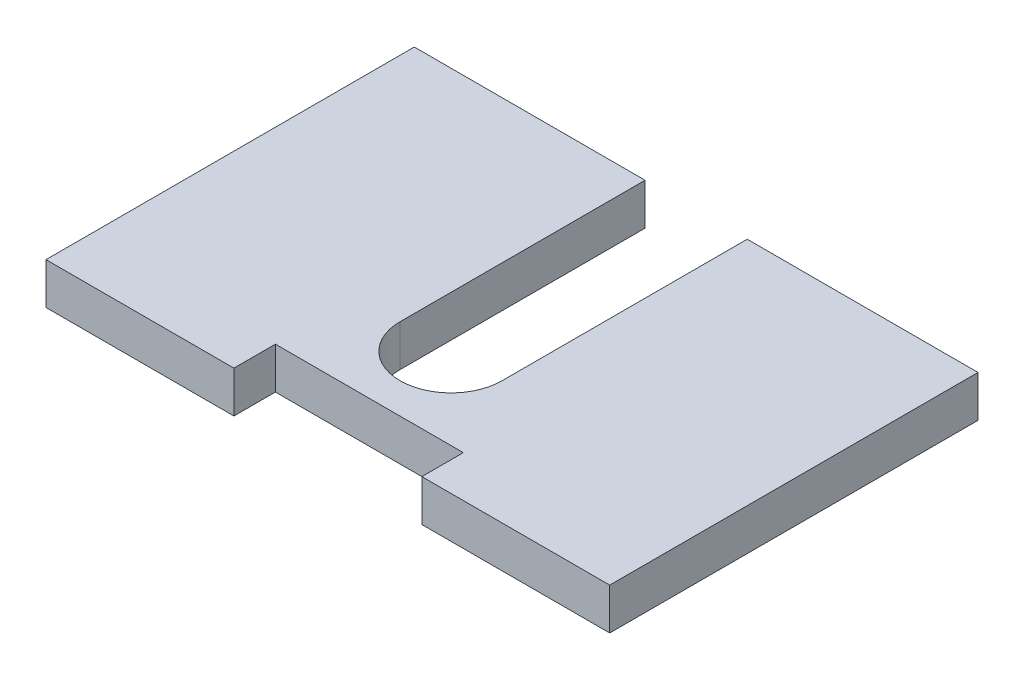
ISO-10303-21;
HEADER;
FILE_DESCRIPTION(('STEP AP214'),'2;1');
FILE_NAME('part.step','',(''),(''),'','','');
FILE_SCHEMA(('AUTOMOTIVE_DESIGN { 1 0 10303 214 1 1 1 1 }'));
ENDSEC;
DATA;
#1=APPLICATION_CONTEXT('core data for automotive mechanical design processes');
#2=APPLICATION_PROTOCOL_DEFINITION('international standard','automotive_design',2000,#1);
#3=PRODUCT_CONTEXT('',#1,'mechanical');
#4=PRODUCT('Part','Part','',(#3));
#5=PRODUCT_RELATED_PRODUCT_CATEGORY('part','',(#4));
#6=PRODUCT_DEFINITION_FORMATION('','',#4);
#7=PRODUCT_DEFINITION_CONTEXT('part definition',#1,'design');
#8=PRODUCT_DEFINITION('design','',#6,#7);
#9=PRODUCT_DEFINITION_SHAPE('','',#8);
#10=(LENGTH_UNIT() NAMED_UNIT(*) SI_UNIT(.MILLI.,.METRE.));
#11=(NAMED_UNIT(*) PLANE_ANGLE_UNIT() SI_UNIT($,.RADIAN.));
#12=(NAMED_UNIT(*) SI_UNIT($,.STERADIAN.) SOLID_ANGLE_UNIT());
#13=UNCERTAINTY_MEASURE_WITH_UNIT(LENGTH_MEASURE(1.E-05),#10,'distance_accuracy_value','');
#14=(GEOMETRIC_REPRESENTATION_CONTEXT(3) GLOBAL_UNCERTAINTY_ASSIGNED_CONTEXT((#13)) GLOBAL_UNIT_ASSIGNED_CONTEXT((#10,
#11,#12)) REPRESENTATION_CONTEXT('',''));
#15=CARTESIAN_POINT('',(0.,0.,0.));
#16=DIRECTION('',(0.,0.,1.));
#17=DIRECTION('',(1.,0.,0.));
#18=AXIS2_PLACEMENT_3D('',#15,#16,#17);
#19=CARTESIAN_POINT('',(0.,5.08,-40.));
#20=DIRECTION('',(0.,0.,1.));
#21=DIRECTION('',(1.,0.,0.));
#22=AXIS2_PLACEMENT_3D('',#19,#20,#21);
#23=PLANE('',#22);
#24=DIRECTION('',(0.,1.,0.));
#25=VECTOR('',#24,1.);
#26=CARTESIAN_POINT('',(-40.75,0.,-40.));
#27=LINE('',#26,#25);
#28=CARTESIAN_POINT('',(-40.75,0.,-40.));
#29=VERTEX_POINT('',#28);
#30=CARTESIAN_POINT('',(-40.75,5.08,-40.));
#31=VERTEX_POINT('',#30);
#32=EDGE_CURVE('E153',#29,#31,#27,.T.);
#33=ORIENTED_EDGE('',*,*,#32,.F.);
#34=DIRECTION('',(-1.,0.,0.));
#35=VECTOR('',#34,1.);
#36=CARTESIAN_POINT('',(0.,0.,-40.));
#37=LINE('',#36,#35);
#38=CARTESIAN_POINT('',(-69.,0.,-40.));
#39=VERTEX_POINT('',#38);
#40=EDGE_CURVE('E208',#29,#39,#37,.T.);
#41=ORIENTED_EDGE('',*,*,#40,.T.);
#42=DIRECTION('',(0.,-1.,0.));
#43=VECTOR('',#42,1.);
#44=CARTESIAN_POINT('',(-69.,5.08,-40.));
#45=LINE('',#44,#43);
#46=CARTESIAN_POINT('',(-69.,5.08,-40.));
#47=VERTEX_POINT('',#46);
#48=EDGE_CURVE('E43',#47,#39,#45,.T.);
#49=ORIENTED_EDGE('',*,*,#48,.F.);
#50=DIRECTION('',(-1.,0.,0.));
#51=VECTOR('',#50,1.);
#52=CARTESIAN_POINT('',(0.,5.08,-40.));
#53=LINE('',#52,#51);
#54=EDGE_CURVE('E197',#31,#47,#53,.T.);
#55=ORIENTED_EDGE('',*,*,#54,.F.);
#56=EDGE_LOOP('',(#33,#41,#49,#55));
#57=FACE_BOUND('',#56,.T.);
#58=ADVANCED_FACE('F35',(#57),#23,.F.);
#59=CARTESIAN_POINT('',(0.,5.08,0.));
#60=DIRECTION('',(0.,1.,0.));
#61=DIRECTION('',(0.,0.,1.));
#62=AXIS2_PLACEMENT_3D('',#59,#60,#61);
#63=PLANE('',#62);
#64=CARTESIAN_POINT('',(-34.5,5.08,-10.));
#65=DIRECTION('',(0.,1.,0.));
#66=DIRECTION('',(0.,0.,1.));
#67=AXIS2_PLACEMENT_3D('',#64,#65,#66);
#68=CIRCLE('',#67,6.25);
#69=CARTESIAN_POINT('',(-40.75,5.08,-10.));
#70=VERTEX_POINT('',#69);
#71=CARTESIAN_POINT('',(-28.25,5.08,-10.));
#72=VERTEX_POINT('',#71);
#73=EDGE_CURVE('E131',#70,#72,#68,.T.);
#74=ORIENTED_EDGE('',*,*,#73,.F.);
#75=DIRECTION('',(0.,0.,-1.));
#76=VECTOR('',#75,1.);
#77=CARTESIAN_POINT('',(-40.75,5.08,0.));
#78=LINE('',#77,#76);
#79=EDGE_CURVE('E142',#70,#31,#78,.T.);
#80=ORIENTED_EDGE('',*,*,#79,.T.);
#81=ORIENTED_EDGE('',*,*,#54,.T.);
#82=DIRECTION('',(0.,0.,1.));
#83=VECTOR('',#82,1.);
#84=CARTESIAN_POINT('',(-69.,5.08,0.));
#85=LINE('',#84,#83);
#86=CARTESIAN_POINT('',(-69.,5.08,5.08));
#87=VERTEX_POINT('',#86);
#88=EDGE_CURVE('E202',#47,#87,#85,.T.);
#89=ORIENTED_EDGE('',*,*,#88,.T.);
#90=DIRECTION('',(-1.,0.,0.));
#91=VECTOR('',#90,1.);
#92=CARTESIAN_POINT('',(-69.,5.08,5.08));
#93=LINE('',#92,#91);
#94=CARTESIAN_POINT('',(-46.,5.08,5.08));
#95=VERTEX_POINT('',#94);
#96=EDGE_CURVE('E182',#95,#87,#93,.T.);
#97=ORIENTED_EDGE('',*,*,#96,.F.);
#98=DIRECTION('',(0.,0.,-1.));
#99=VECTOR('',#98,1.);
#100=CARTESIAN_POINT('',(-46.,5.08,5.08));
#101=LINE('',#100,#99);
#102=CARTESIAN_POINT('',(-46.,5.08,0.));
#103=VERTEX_POINT('',#102);
#104=EDGE_CURVE('E185',#95,#103,#101,.T.);
#105=ORIENTED_EDGE('',*,*,#104,.T.);
#106=DIRECTION('',(1.,0.,0.));
#107=VECTOR('',#106,1.);
#108=CARTESIAN_POINT('',(0.,5.08,0.));
#109=LINE('',#108,#107);
#110=CARTESIAN_POINT('',(-23.,5.08,0.));
#111=VERTEX_POINT('',#110);
#112=EDGE_CURVE('E204',#103,#111,#109,.T.);
#113=ORIENTED_EDGE('',*,*,#112,.T.);
#114=DIRECTION('',(0.,0.,-1.));
#115=VECTOR('',#114,1.);
#116=CARTESIAN_POINT('',(-23.,5.08,5.08));
#117=LINE('',#116,#115);
#118=CARTESIAN_POINT('',(-23.,5.08,5.08));
#119=VERTEX_POINT('',#118);
#120=EDGE_CURVE('E167',#119,#111,#117,.T.);
#121=ORIENTED_EDGE('',*,*,#120,.F.);
#122=DIRECTION('',(-1.,0.,0.));
#123=VECTOR('',#122,1.);
#124=CARTESIAN_POINT('',(-23.,5.08,5.08));
#125=LINE('',#124,#123);
#126=CARTESIAN_POINT('',(0.,5.08,5.08));
#127=VERTEX_POINT('',#126);
#128=EDGE_CURVE('E165',#127,#119,#125,.T.);
#129=ORIENTED_EDGE('',*,*,#128,.F.);
#130=DIRECTION('',(0.,0.,-1.));
#131=VECTOR('',#130,1.);
#132=CARTESIAN_POINT('',(0.,5.08,0.));
#133=LINE('',#132,#131);
#134=CARTESIAN_POINT('',(0.,5.08,-40.));
#135=VERTEX_POINT('',#134);
#136=EDGE_CURVE('E194',#127,#135,#133,.T.);
#137=ORIENTED_EDGE('',*,*,#136,.T.);
#138=CARTESIAN_POINT('',(-28.25,5.08,-40.));
#139=VERTEX_POINT('',#138);
#140=EDGE_CURVE('E199',#135,#139,#53,.T.);
#141=ORIENTED_EDGE('',*,*,#140,.T.);
#142=DIRECTION('',(0.,0.,-1.));
#143=VECTOR('',#142,1.);
#144=CARTESIAN_POINT('',(-28.25,5.08,0.));
#145=LINE('',#144,#143);
#146=EDGE_CURVE('E145',#72,#139,#145,.T.);
#147=ORIENTED_EDGE('',*,*,#146,.F.);
#148=EDGE_LOOP('',(#74,#80,#81,#89,#97,#105,#113,#121,#129,#137,#141,#147));
#149=FACE_BOUND('',#148,.T.);
#150=ADVANCED_FACE('F231',(#149),#63,.T.);
#151=CARTESIAN_POINT('',(0.,0.,0.));
#152=DIRECTION('',(0.,1.,0.));
#153=DIRECTION('',(0.,0.,1.));
#154=AXIS2_PLACEMENT_3D('',#151,#152,#153);
#155=PLANE('',#154);
#156=DIRECTION('',(0.,0.,-1.));
#157=VECTOR('',#156,1.);
#158=CARTESIAN_POINT('',(-40.75,0.,0.));
#159=LINE('',#158,#157);
#160=CARTESIAN_POINT('',(-40.75,0.,-10.));
#161=VERTEX_POINT('',#160);
#162=EDGE_CURVE('E133',#161,#29,#159,.T.);
#163=ORIENTED_EDGE('',*,*,#162,.F.);
#164=CARTESIAN_POINT('',(-34.5,0.,-10.));
#165=DIRECTION('',(0.,1.,0.));
#166=DIRECTION('',(0.,0.,1.));
#167=AXIS2_PLACEMENT_3D('',#164,#165,#166);
#168=CIRCLE('',#167,6.25);
#169=CARTESIAN_POINT('',(-28.25,0.,-10.));
#170=VERTEX_POINT('',#169);
#171=EDGE_CURVE('E128',#161,#170,#168,.T.);
#172=ORIENTED_EDGE('',*,*,#171,.T.);
#173=DIRECTION('',(0.,0.,-1.));
#174=VECTOR('',#173,1.);
#175=CARTESIAN_POINT('',(-28.25,0.,0.));
#176=LINE('',#175,#174);
#177=CARTESIAN_POINT('',(-28.25,0.,-40.));
#178=VERTEX_POINT('',#177);
#179=EDGE_CURVE('E135',#170,#178,#176,.T.);
#180=ORIENTED_EDGE('',*,*,#179,.T.);
#181=CARTESIAN_POINT('',(0.,0.,-40.));
#182=VERTEX_POINT('',#181);
#183=EDGE_CURVE('E209',#182,#178,#37,.T.);
#184=ORIENTED_EDGE('',*,*,#183,.F.);
#185=DIRECTION('',(0.,0.,-1.));
#186=VECTOR('',#185,1.);
#187=CARTESIAN_POINT('',(0.,0.,0.));
#188=LINE('',#187,#186);
#189=CARTESIAN_POINT('',(0.,0.,5.08));
#190=VERTEX_POINT('',#189);
#191=EDGE_CURVE('E193',#190,#182,#188,.T.);
#192=ORIENTED_EDGE('',*,*,#191,.F.);
#193=DIRECTION('',(1.,0.,0.));
#194=VECTOR('',#193,1.);
#195=CARTESIAN_POINT('',(-23.,0.,5.08));
#196=LINE('',#195,#194);
#197=CARTESIAN_POINT('',(-23.,0.,5.08));
#198=VERTEX_POINT('',#197);
#199=EDGE_CURVE('E159',#198,#190,#196,.T.);
#200=ORIENTED_EDGE('',*,*,#199,.F.);
#201=DIRECTION('',(0.,0.,-1.));
#202=VECTOR('',#201,1.);
#203=CARTESIAN_POINT('',(-23.,0.,5.08));
#204=LINE('',#203,#202);
#205=CARTESIAN_POINT('',(-23.,0.,0.));
#206=VERTEX_POINT('',#205);
#207=EDGE_CURVE('E171',#198,#206,#204,.T.);
#208=ORIENTED_EDGE('',*,*,#207,.T.);
#209=DIRECTION('',(1.,0.,0.));
#210=VECTOR('',#209,1.);
#211=CARTESIAN_POINT('',(0.,0.,0.));
#212=LINE('',#211,#210);
#213=CARTESIAN_POINT('',(-46.,0.,0.));
#214=VERTEX_POINT('',#213);
#215=EDGE_CURVE('E198',#214,#206,#212,.T.);
#216=ORIENTED_EDGE('',*,*,#215,.F.);
#217=DIRECTION('',(0.,0.,-1.));
#218=VECTOR('',#217,1.);
#219=CARTESIAN_POINT('',(-46.,0.,5.08));
#220=LINE('',#219,#218);
#221=CARTESIAN_POINT('',(-46.,0.,5.08));
#222=VERTEX_POINT('',#221);
#223=EDGE_CURVE('E190',#222,#214,#220,.T.);
#224=ORIENTED_EDGE('',*,*,#223,.F.);
#225=DIRECTION('',(1.,0.,0.));
#226=VECTOR('',#225,1.);
#227=CARTESIAN_POINT('',(-69.,0.,5.08));
#228=LINE('',#227,#226);
#229=CARTESIAN_POINT('',(-69.,0.,5.08));
#230=VERTEX_POINT('',#229);
#231=EDGE_CURVE('E178',#230,#222,#228,.T.);
#232=ORIENTED_EDGE('',*,*,#231,.F.);
#233=DIRECTION('',(0.,0.,1.));
#234=VECTOR('',#233,1.);
#235=CARTESIAN_POINT('',(-69.,0.,0.));
#236=LINE('',#235,#234);
#237=EDGE_CURVE('E211',#39,#230,#236,.T.);
#238=ORIENTED_EDGE('',*,*,#237,.F.);
#239=ORIENTED_EDGE('',*,*,#40,.F.);
#240=EDGE_LOOP('',(#163,#172,#180,#184,#192,#200,#208,#216,#224,#232,#238,#239));
#241=FACE_BOUND('',#240,.T.);
#242=ADVANCED_FACE('F140',(#241),#155,.F.);
#243=CARTESIAN_POINT('',(0.,5.08,0.));
#244=DIRECTION('',(0.,0.,-1.));
#245=DIRECTION('',(-1.,0.,0.));
#246=AXIS2_PLACEMENT_3D('',#243,#244,#245);
#247=PLANE('',#246);
#248=DIRECTION('',(0.,-1.,0.));
#249=VECTOR('',#248,1.);
#250=CARTESIAN_POINT('',(-23.,0.,0.));
#251=LINE('',#250,#249);
#252=EDGE_CURVE('E58',#111,#206,#251,.T.);
#253=ORIENTED_EDGE('',*,*,#252,.F.);
#254=ORIENTED_EDGE('',*,*,#112,.F.);
#255=DIRECTION('',(0.,1.,0.));
#256=VECTOR('',#255,1.);
#257=CARTESIAN_POINT('',(-46.,0.,0.));
#258=LINE('',#257,#256);
#259=EDGE_CURVE('E174',#214,#103,#258,.T.);
#260=ORIENTED_EDGE('',*,*,#259,.F.);
#261=ORIENTED_EDGE('',*,*,#215,.T.);
#262=EDGE_LOOP('',(#253,#254,#260,#261));
#263=FACE_BOUND('',#262,.T.);
#264=ADVANCED_FACE('F251',(#263),#247,.F.);
#265=CARTESIAN_POINT('',(0.,5.08,0.));
#266=DIRECTION('',(-1.,0.,0.));
#267=DIRECTION('',(0.,0.,1.));
#268=AXIS2_PLACEMENT_3D('',#265,#266,#267);
#269=PLANE('',#268);
#270=ORIENTED_EDGE('',*,*,#191,.T.);
#271=DIRECTION('',(0.,-1.,0.));
#272=VECTOR('',#271,1.);
#273=CARTESIAN_POINT('',(0.,5.08,-40.));
#274=LINE('',#273,#272);
#275=EDGE_CURVE('E11',#135,#182,#274,.T.);
#276=ORIENTED_EDGE('',*,*,#275,.F.);
#277=ORIENTED_EDGE('',*,*,#136,.F.);
#278=DIRECTION('',(0.,1.,0.));
#279=VECTOR('',#278,1.);
#280=CARTESIAN_POINT('',(0.,0.,5.08));
#281=LINE('',#280,#279);
#282=EDGE_CURVE('E162',#190,#127,#281,.T.);
#283=ORIENTED_EDGE('',*,*,#282,.F.);
#284=EDGE_LOOP('',(#270,#276,#277,#283));
#285=FACE_BOUND('',#284,.T.);
#286=ADVANCED_FACE('F37',(#285),#269,.F.);
#287=ORIENTED_EDGE('',*,*,#183,.T.);
#288=DIRECTION('',(0.,1.,0.));
#289=VECTOR('',#288,1.);
#290=CARTESIAN_POINT('',(-28.25,0.,-40.));
#291=LINE('',#290,#289);
#292=EDGE_CURVE('E50',#178,#139,#291,.T.);
#293=ORIENTED_EDGE('',*,*,#292,.T.);
#294=ORIENTED_EDGE('',*,*,#140,.F.);
#295=ORIENTED_EDGE('',*,*,#275,.T.);
#296=EDGE_LOOP('',(#287,#293,#294,#295));
#297=FACE_BOUND('',#296,.T.);
#298=ADVANCED_FACE('F237',(#297),#23,.F.);
#299=CARTESIAN_POINT('',(-69.,5.08,0.));
#300=DIRECTION('',(1.,0.,0.));
#301=DIRECTION('',(0.,0.,-1.));
#302=AXIS2_PLACEMENT_3D('',#299,#300,#301);
#303=PLANE('',#302);
#304=ORIENTED_EDGE('',*,*,#237,.T.);
#305=DIRECTION('',(0.,-1.,0.));
#306=VECTOR('',#305,1.);
#307=CARTESIAN_POINT('',(-69.,0.,5.08));
#308=LINE('',#307,#306);
#309=EDGE_CURVE('E175',#87,#230,#308,.T.);
#310=ORIENTED_EDGE('',*,*,#309,.F.);
#311=ORIENTED_EDGE('',*,*,#88,.F.);
#312=ORIENTED_EDGE('',*,*,#48,.T.);
#313=EDGE_LOOP('',(#304,#310,#311,#312));
#314=FACE_BOUND('',#313,.T.);
#315=ADVANCED_FACE('F218',(#314),#303,.F.);
#316=CARTESIAN_POINT('',(-46.,0.,5.08));
#317=DIRECTION('',(-1.,0.,0.));
#318=DIRECTION('',(0.,0.,1.));
#319=AXIS2_PLACEMENT_3D('',#316,#317,#318);
#320=PLANE('',#319);
#321=ORIENTED_EDGE('',*,*,#259,.T.);
#322=ORIENTED_EDGE('',*,*,#104,.F.);
#323=DIRECTION('',(0.,1.,0.));
#324=VECTOR('',#323,1.);
#325=CARTESIAN_POINT('',(-46.,0.,5.08));
#326=LINE('',#325,#324);
#327=EDGE_CURVE('E180',#222,#95,#326,.T.);
#328=ORIENTED_EDGE('',*,*,#327,.F.);
#329=ORIENTED_EDGE('',*,*,#223,.T.);
#330=EDGE_LOOP('',(#321,#322,#328,#329));
#331=FACE_BOUND('',#330,.T.);
#332=ADVANCED_FACE('F250',(#331),#320,.F.);
#333=CARTESIAN_POINT('',(0.,0.,5.08));
#334=DIRECTION('',(0.,0.,-1.));
#335=DIRECTION('',(-1.,0.,0.));
#336=AXIS2_PLACEMENT_3D('',#333,#334,#335);
#337=PLANE('',#336);
#338=ORIENTED_EDGE('',*,*,#309,.T.);
#339=ORIENTED_EDGE('',*,*,#231,.T.);
#340=ORIENTED_EDGE('',*,*,#327,.T.);
#341=ORIENTED_EDGE('',*,*,#96,.T.);
#342=EDGE_LOOP('',(#338,#339,#340,#341));
#343=FACE_BOUND('',#342,.T.);
#344=ADVANCED_FACE('F227',(#343),#337,.F.);
#345=CARTESIAN_POINT('',(-23.,0.,5.08));
#346=DIRECTION('',(1.,0.,0.));
#347=DIRECTION('',(0.,0.,-1.));
#348=AXIS2_PLACEMENT_3D('',#345,#346,#347);
#349=PLANE('',#348);
#350=ORIENTED_EDGE('',*,*,#252,.T.);
#351=ORIENTED_EDGE('',*,*,#207,.F.);
#352=DIRECTION('',(0.,-1.,0.));
#353=VECTOR('',#352,1.);
#354=CARTESIAN_POINT('',(-23.,0.,5.08));
#355=LINE('',#354,#353);
#356=EDGE_CURVE('E156',#119,#198,#355,.T.);
#357=ORIENTED_EDGE('',*,*,#356,.F.);
#358=ORIENTED_EDGE('',*,*,#120,.T.);
#359=EDGE_LOOP('',(#350,#351,#357,#358));
#360=FACE_BOUND('',#359,.T.);
#361=ADVANCED_FACE('F248',(#360),#349,.F.);
#362=CARTESIAN_POINT('',(0.,0.,5.08));
#363=DIRECTION('',(0.,0.,-1.));
#364=DIRECTION('',(-1.,0.,0.));
#365=AXIS2_PLACEMENT_3D('',#362,#363,#364);
#366=PLANE('',#365);
#367=ORIENTED_EDGE('',*,*,#356,.T.);
#368=ORIENTED_EDGE('',*,*,#199,.T.);
#369=ORIENTED_EDGE('',*,*,#282,.T.);
#370=ORIENTED_EDGE('',*,*,#128,.T.);
#371=EDGE_LOOP('',(#367,#368,#369,#370));
#372=FACE_BOUND('',#371,.T.);
#373=ADVANCED_FACE('F242',(#372),#366,.F.);
#374=CARTESIAN_POINT('',(-34.5,0.,-10.));
#375=DIRECTION('',(0.,1.,0.));
#376=DIRECTION('',(0.,0.,1.));
#377=AXIS2_PLACEMENT_3D('',#374,#375,#376);
#378=CYLINDRICAL_SURFACE('',#377,6.25);
#379=ORIENTED_EDGE('',*,*,#73,.T.);
#380=DIRECTION('',(0.,1.,0.));
#381=VECTOR('',#380,1.);
#382=CARTESIAN_POINT('',(-28.25,0.,-10.));
#383=LINE('',#382,#381);
#384=EDGE_CURVE('E125',#170,#72,#383,.T.);
#385=ORIENTED_EDGE('',*,*,#384,.F.);
#386=ORIENTED_EDGE('',*,*,#171,.F.);
#387=DIRECTION('',(0.,1.,0.));
#388=VECTOR('',#387,1.);
#389=CARTESIAN_POINT('',(-40.75,0.,-10.));
#390=LINE('',#389,#388);
#391=EDGE_CURVE('E151',#161,#70,#390,.T.);
#392=ORIENTED_EDGE('',*,*,#391,.T.);
#393=EDGE_LOOP('',(#379,#385,#386,#392));
#394=FACE_BOUND('',#393,.T.);
#395=ADVANCED_FACE('F126',(#394),#378,.F.);
#396=CARTESIAN_POINT('',(-40.75,0.,0.));
#397=DIRECTION('',(1.,0.,0.));
#398=DIRECTION('',(0.,0.,-1.));
#399=AXIS2_PLACEMENT_3D('',#396,#397,#398);
#400=PLANE('',#399);
#401=ORIENTED_EDGE('',*,*,#79,.F.);
#402=ORIENTED_EDGE('',*,*,#391,.F.);
#403=ORIENTED_EDGE('',*,*,#162,.T.);
#404=ORIENTED_EDGE('',*,*,#32,.T.);
#405=EDGE_LOOP('',(#401,#402,#403,#404));
#406=FACE_BOUND('',#405,.T.);
#407=ADVANCED_FACE('F235',(#406),#400,.T.);
#408=CARTESIAN_POINT('',(-28.25,0.,0.));
#409=DIRECTION('',(1.,0.,0.));
#410=DIRECTION('',(0.,0.,-1.));
#411=AXIS2_PLACEMENT_3D('',#408,#409,#410);
#412=PLANE('',#411);
#413=ORIENTED_EDGE('',*,*,#146,.T.);
#414=ORIENTED_EDGE('',*,*,#292,.F.);
#415=ORIENTED_EDGE('',*,*,#179,.F.);
#416=ORIENTED_EDGE('',*,*,#384,.T.);
#417=EDGE_LOOP('',(#413,#414,#415,#416));
#418=FACE_BOUND('',#417,.T.);
#419=ADVANCED_FACE('F136',(#418),#412,.F.);
#420=CLOSED_SHELL('',(#58,#150,#242,#264,#286,#298,#315,#332,#344,#361,#373,#395,#407,#419));
#421=MANIFOLD_SOLID_BREP('B2',#420);
#422=ADVANCED_BREP_SHAPE_REPRESENTATION('',(#18,#421),#14);
#423=SHAPE_DEFINITION_REPRESENTATION(#9,#422);
ENDSEC;
END-ISO-10303-21;
